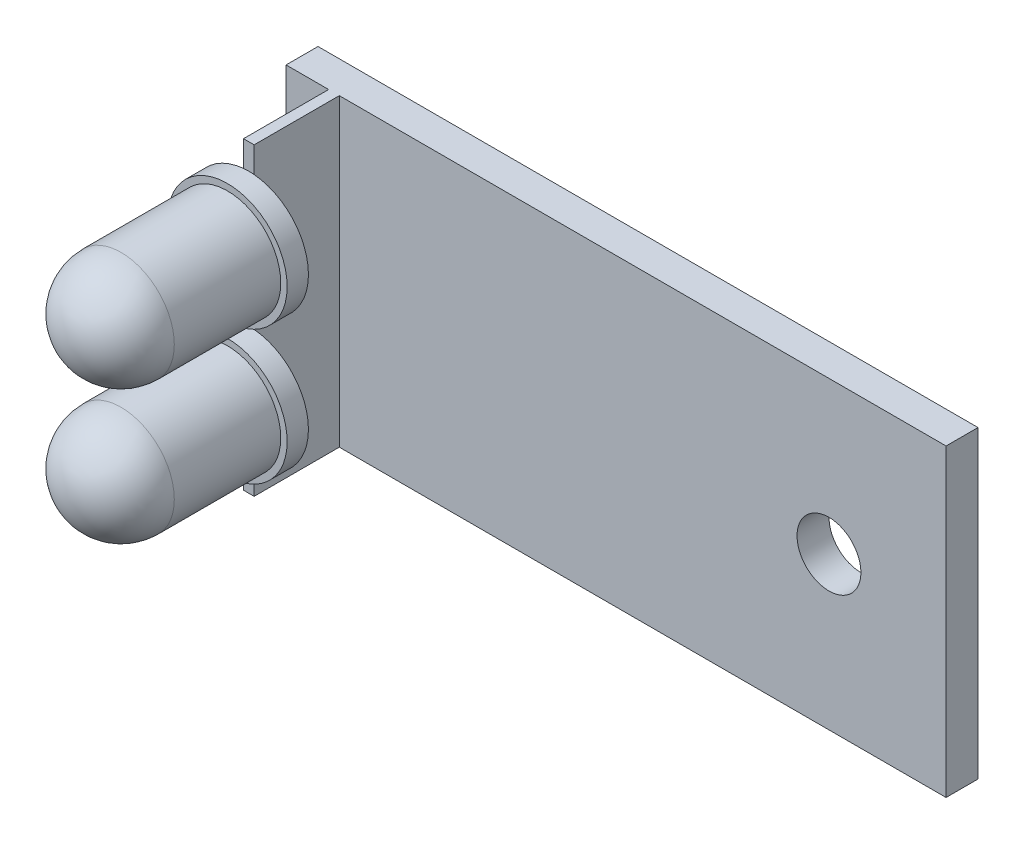
ISO-10303-21;
HEADER;
FILE_DESCRIPTION(('STEP AP214'),'2;1');
FILE_NAME('part.step','',(''),(''),'','','');
FILE_SCHEMA(('AUTOMOTIVE_DESIGN { 1 0 10303 214 1 1 1 1 }'));
ENDSEC;
DATA;
#1=APPLICATION_CONTEXT('core data for automotive mechanical design processes');
#2=APPLICATION_PROTOCOL_DEFINITION('international standard','automotive_design',2000,#1);
#3=PRODUCT_CONTEXT('',#1,'mechanical');
#4=PRODUCT('Part','Part','',(#3));
#5=PRODUCT_RELATED_PRODUCT_CATEGORY('part','',(#4));
#6=PRODUCT_DEFINITION_FORMATION('','',#4);
#7=PRODUCT_DEFINITION_CONTEXT('part definition',#1,'design');
#8=PRODUCT_DEFINITION('design','',#6,#7);
#9=PRODUCT_DEFINITION_SHAPE('','',#8);
#10=(LENGTH_UNIT() NAMED_UNIT(*) SI_UNIT(.MILLI.,.METRE.));
#11=(NAMED_UNIT(*) PLANE_ANGLE_UNIT() SI_UNIT($,.RADIAN.));
#12=(NAMED_UNIT(*) SI_UNIT($,.STERADIAN.) SOLID_ANGLE_UNIT());
#13=UNCERTAINTY_MEASURE_WITH_UNIT(LENGTH_MEASURE(1.E-05),#10,'distance_accuracy_value','');
#14=(GEOMETRIC_REPRESENTATION_CONTEXT(3) GLOBAL_UNCERTAINTY_ASSIGNED_CONTEXT((#13)) GLOBAL_UNIT_ASSIGNED_CONTEXT((#10,
#11,#12)) REPRESENTATION_CONTEXT('',''));
#15=CARTESIAN_POINT('',(0.,0.,0.));
#16=DIRECTION('',(0.,0.,1.));
#17=DIRECTION('',(1.,0.,0.));
#18=AXIS2_PLACEMENT_3D('',#15,#16,#17);
#19=CARTESIAN_POINT('',(2.,7.15,5.5));
#20=DIRECTION('',(0.,0.,1.));
#21=DIRECTION('',(1.,0.,0.));
#22=AXIS2_PLACEMENT_3D('',#19,#20,#21);
#23=PLANE('',#22);
#24=DIRECTION('',(0.,-1.,0.));
#25=VECTOR('',#24,1.);
#26=CARTESIAN_POINT('',(2.5,7.15,5.5));
#27=LINE('',#26,#25);
#28=CARTESIAN_POINT('',(2.5,0.361183046523129,5.5));
#29=VERTEX_POINT('',#28);
#30=CARTESIAN_POINT('',(2.5,-0.361183046523129,5.5));
#31=VERTEX_POINT('',#30);
#32=EDGE_CURVE('E145',#29,#31,#27,.T.);
#33=ORIENTED_EDGE('',*,*,#32,.F.);
#34=CARTESIAN_POINT('',(2.25,3.15,5.5));
#35=DIRECTION('',(0.,0.,-1.));
#36=DIRECTION('',(1.,0.,0.));
#37=AXIS2_PLACEMENT_3D('',#34,#35,#36);
#38=CIRCLE('',#37,2.8);
#39=CARTESIAN_POINT('',(2.,0.361183046523129,5.5));
#40=VERTEX_POINT('',#39);
#41=EDGE_CURVE('E53',#29,#40,#38,.T.);
#42=ORIENTED_EDGE('',*,*,#41,.T.);
#43=DIRECTION('',(0.,-1.,0.));
#44=VECTOR('',#43,1.);
#45=CARTESIAN_POINT('',(2.,7.15,5.5));
#46=LINE('',#45,#44);
#47=CARTESIAN_POINT('',(2.,-0.361183046523129,5.5));
#48=VERTEX_POINT('',#47);
#49=EDGE_CURVE('E143',#40,#48,#46,.T.);
#50=ORIENTED_EDGE('',*,*,#49,.T.);
#51=CARTESIAN_POINT('',(2.25,-3.15,5.5));
#52=DIRECTION('',(0.,0.,1.));
#53=DIRECTION('',(1.,0.,0.));
#54=AXIS2_PLACEMENT_3D('',#51,#52,#53);
#55=CIRCLE('',#54,2.8);
#56=EDGE_CURVE('E45',#31,#48,#55,.T.);
#57=ORIENTED_EDGE('',*,*,#56,.F.);
#58=EDGE_LOOP('',(#33,#42,#50,#57));
#59=FACE_BOUND('',#58,.T.);
#60=ADVANCED_FACE('F35',(#59),#23,.T.);
#61=CARTESIAN_POINT('',(2.,7.15,5.5));
#62=VERTEX_POINT('',#61);
#63=CARTESIAN_POINT('',(2.,5.93881695347687,5.5));
#64=VERTEX_POINT('',#63);
#65=EDGE_CURVE('E153',#62,#64,#46,.T.);
#66=ORIENTED_EDGE('',*,*,#65,.T.);
#67=CARTESIAN_POINT('',(2.5,5.93881695347687,5.5));
#68=VERTEX_POINT('',#67);
#69=EDGE_CURVE('E138',#64,#68,#38,.T.);
#70=ORIENTED_EDGE('',*,*,#69,.T.);
#71=CARTESIAN_POINT('',(2.5,7.15,5.5));
#72=VERTEX_POINT('',#71);
#73=EDGE_CURVE('E159',#72,#68,#27,.T.);
#74=ORIENTED_EDGE('',*,*,#73,.F.);
#75=DIRECTION('',(-1.,0.,0.));
#76=VECTOR('',#75,1.);
#77=CARTESIAN_POINT('',(2.,7.15,5.5));
#78=LINE('',#77,#76);
#79=EDGE_CURVE('E176',#72,#62,#78,.T.);
#80=ORIENTED_EDGE('',*,*,#79,.T.);
#81=EDGE_LOOP('',(#66,#70,#74,#80));
#82=FACE_BOUND('',#81,.T.);
#83=ADVANCED_FACE('F294',(#82),#23,.T.);
#84=CARTESIAN_POINT('',(0.,0.,1.5));
#85=DIRECTION('',(0.,0.,-1.));
#86=DIRECTION('',(-1.,0.,0.));
#87=AXIS2_PLACEMENT_3D('',#84,#85,#86);
#88=PLANE('',#87);
#89=DIRECTION('',(0.,-1.,0.));
#90=VECTOR('',#89,1.);
#91=CARTESIAN_POINT('',(2.,7.15,1.5));
#92=LINE('',#91,#90);
#93=CARTESIAN_POINT('',(2.,7.15,1.5));
#94=VERTEX_POINT('',#93);
#95=CARTESIAN_POINT('',(2.,-7.15,1.5));
#96=VERTEX_POINT('',#95);
#97=EDGE_CURVE('E156',#94,#96,#92,.T.);
#98=ORIENTED_EDGE('',*,*,#97,.F.);
#99=DIRECTION('',(-1.,0.,0.));
#100=VECTOR('',#99,1.);
#101=CARTESIAN_POINT('',(0.,7.15,1.5));
#102=LINE('',#101,#100);
#103=CARTESIAN_POINT('',(0.,7.15,1.5));
#104=VERTEX_POINT('',#103);
#105=EDGE_CURVE('E189',#94,#104,#102,.T.);
#106=ORIENTED_EDGE('',*,*,#105,.T.);
#107=DIRECTION('',(0.,-1.,0.));
#108=VECTOR('',#107,1.);
#109=CARTESIAN_POINT('',(0.,-7.15,1.5));
#110=LINE('',#109,#108);
#111=CARTESIAN_POINT('',(0.,-7.15,1.5));
#112=VERTEX_POINT('',#111);
#113=EDGE_CURVE('E179',#104,#112,#110,.T.);
#114=ORIENTED_EDGE('',*,*,#113,.T.);
#115=DIRECTION('',(1.,0.,0.));
#116=VECTOR('',#115,1.);
#117=CARTESIAN_POINT('',(0.,-7.15,1.5));
#118=LINE('',#117,#116);
#119=EDGE_CURVE('E184',#112,#96,#118,.T.);
#120=ORIENTED_EDGE('',*,*,#119,.T.);
#121=EDGE_LOOP('',(#98,#106,#114,#120));
#122=FACE_BOUND('',#121,.T.);
#123=ADVANCED_FACE('F246',(#122),#88,.F.);
#124=CARTESIAN_POINT('',(0.,-7.15,1.5));
#125=DIRECTION('',(1.,0.,0.));
#126=DIRECTION('',(0.,1.,0.));
#127=AXIS2_PLACEMENT_3D('',#124,#125,#126);
#128=PLANE('',#127);
#129=DIRECTION('',(0.,-1.,0.));
#130=VECTOR('',#129,1.);
#131=CARTESIAN_POINT('',(0.,-7.15,0.));
#132=LINE('',#131,#130);
#133=CARTESIAN_POINT('',(0.,7.15,0.));
#134=VERTEX_POINT('',#133);
#135=CARTESIAN_POINT('',(0.,-7.15,0.));
#136=VERTEX_POINT('',#135);
#137=EDGE_CURVE('E193',#134,#136,#132,.T.);
#138=ORIENTED_EDGE('',*,*,#137,.T.);
#139=DIRECTION('',(0.,0.,-1.));
#140=VECTOR('',#139,1.);
#141=CARTESIAN_POINT('',(0.,-7.15,1.5));
#142=LINE('',#141,#140);
#143=EDGE_CURVE('E39',#112,#136,#142,.T.);
#144=ORIENTED_EDGE('',*,*,#143,.F.);
#145=ORIENTED_EDGE('',*,*,#113,.F.);
#146=DIRECTION('',(0.,0.,-1.));
#147=VECTOR('',#146,1.);
#148=CARTESIAN_POINT('',(0.,7.15,1.5));
#149=LINE('',#148,#147);
#150=EDGE_CURVE('E192',#104,#134,#149,.T.);
#151=ORIENTED_EDGE('',*,*,#150,.T.);
#152=EDGE_LOOP('',(#138,#144,#145,#151));
#153=FACE_BOUND('',#152,.T.);
#154=ADVANCED_FACE('F37',(#153),#128,.F.);
#155=CARTESIAN_POINT('',(0.,-7.15,1.5));
#156=DIRECTION('',(0.,1.,0.));
#157=DIRECTION('',(-1.,0.,0.));
#158=AXIS2_PLACEMENT_3D('',#155,#156,#157);
#159=PLANE('',#158);
#160=DIRECTION('',(1.,0.,0.));
#161=VECTOR('',#160,1.);
#162=CARTESIAN_POINT('',(0.,-7.15,0.));
#163=LINE('',#162,#161);
#164=CARTESIAN_POINT('',(31.,-7.15,0.));
#165=VERTEX_POINT('',#164);
#166=EDGE_CURVE('E196',#136,#165,#163,.T.);
#167=ORIENTED_EDGE('',*,*,#166,.T.);
#168=DIRECTION('',(0.,0.,-1.));
#169=VECTOR('',#168,1.);
#170=CARTESIAN_POINT('',(31.,-7.15,1.5));
#171=LINE('',#170,#169);
#172=CARTESIAN_POINT('',(31.,-7.15,1.5));
#173=VERTEX_POINT('',#172);
#174=EDGE_CURVE('E205',#173,#165,#171,.T.);
#175=ORIENTED_EDGE('',*,*,#174,.F.);
#176=CARTESIAN_POINT('',(2.5,-7.15,1.5));
#177=VERTEX_POINT('',#176);
#178=EDGE_CURVE('E182',#177,#173,#118,.T.);
#179=ORIENTED_EDGE('',*,*,#178,.F.);
#180=DIRECTION('',(0.,0.,1.));
#181=VECTOR('',#180,1.);
#182=CARTESIAN_POINT('',(2.5,-7.15,1.5));
#183=LINE('',#182,#181);
#184=CARTESIAN_POINT('',(2.5,-7.15,5.5));
#185=VERTEX_POINT('',#184);
#186=EDGE_CURVE('E233',#177,#185,#183,.T.);
#187=ORIENTED_EDGE('',*,*,#186,.T.);
#188=DIRECTION('',(-1.,0.,0.));
#189=VECTOR('',#188,1.);
#190=CARTESIAN_POINT('',(2.,-7.15,5.5));
#191=LINE('',#190,#189);
#192=CARTESIAN_POINT('',(2.,-7.15,5.5));
#193=VERTEX_POINT('',#192);
#194=EDGE_CURVE('E234',#185,#193,#191,.T.);
#195=ORIENTED_EDGE('',*,*,#194,.T.);
#196=DIRECTION('',(0.,0.,-1.));
#197=VECTOR('',#196,1.);
#198=CARTESIAN_POINT('',(2.,-7.15,1.5));
#199=LINE('',#198,#197);
#200=EDGE_CURVE('E236',#193,#96,#199,.T.);
#201=ORIENTED_EDGE('',*,*,#200,.T.);
#202=ORIENTED_EDGE('',*,*,#119,.F.);
#203=ORIENTED_EDGE('',*,*,#143,.T.);
#204=EDGE_LOOP('',(#167,#175,#179,#187,#195,#201,#202,#203));
#205=FACE_BOUND('',#204,.T.);
#206=ADVANCED_FACE('F214',(#205),#159,.F.);
#207=CARTESIAN_POINT('',(31.,-7.15,1.5));
#208=DIRECTION('',(-1.,0.,0.));
#209=DIRECTION('',(0.,0.,1.));
#210=AXIS2_PLACEMENT_3D('',#207,#208,#209);
#211=PLANE('',#210);
#212=DIRECTION('',(0.,1.,0.));
#213=VECTOR('',#212,1.);
#214=CARTESIAN_POINT('',(31.,-7.15,0.));
#215=LINE('',#214,#213);
#216=CARTESIAN_POINT('',(31.,7.15,0.));
#217=VERTEX_POINT('',#216);
#218=EDGE_CURVE('E198',#165,#217,#215,.T.);
#219=ORIENTED_EDGE('',*,*,#218,.T.);
#220=DIRECTION('',(0.,0.,-1.));
#221=VECTOR('',#220,1.);
#222=CARTESIAN_POINT('',(31.,7.15,1.5));
#223=LINE('',#222,#221);
#224=CARTESIAN_POINT('',(31.,7.15,1.5));
#225=VERTEX_POINT('',#224);
#226=EDGE_CURVE('E203',#225,#217,#223,.T.);
#227=ORIENTED_EDGE('',*,*,#226,.F.);
#228=DIRECTION('',(0.,1.,0.));
#229=VECTOR('',#228,1.);
#230=CARTESIAN_POINT('',(31.,-7.15,1.5));
#231=LINE('',#230,#229);
#232=EDGE_CURVE('E187',#173,#225,#231,.T.);
#233=ORIENTED_EDGE('',*,*,#232,.F.);
#234=ORIENTED_EDGE('',*,*,#174,.T.);
#235=EDGE_LOOP('',(#219,#227,#233,#234));
#236=FACE_BOUND('',#235,.T.);
#237=ADVANCED_FACE('F224',(#236),#211,.F.);
#238=CARTESIAN_POINT('',(0.,7.15,1.5));
#239=DIRECTION('',(0.,-1.,0.));
#240=DIRECTION('',(1.,0.,0.));
#241=AXIS2_PLACEMENT_3D('',#238,#239,#240);
#242=PLANE('',#241);
#243=DIRECTION('',(-1.,0.,0.));
#244=VECTOR('',#243,1.);
#245=CARTESIAN_POINT('',(0.,7.15,0.));
#246=LINE('',#245,#244);
#247=EDGE_CURVE('E183',#217,#134,#246,.T.);
#248=ORIENTED_EDGE('',*,*,#247,.T.);
#249=ORIENTED_EDGE('',*,*,#150,.F.);
#250=ORIENTED_EDGE('',*,*,#105,.F.);
#251=DIRECTION('',(0.,0.,-1.));
#252=VECTOR('',#251,1.);
#253=CARTESIAN_POINT('',(2.,7.15,1.5));
#254=LINE('',#253,#252);
#255=EDGE_CURVE('E172',#62,#94,#254,.T.);
#256=ORIENTED_EDGE('',*,*,#255,.F.);
#257=ORIENTED_EDGE('',*,*,#79,.F.);
#258=DIRECTION('',(0.,0.,1.));
#259=VECTOR('',#258,1.);
#260=CARTESIAN_POINT('',(2.5,7.15,1.5));
#261=LINE('',#260,#259);
#262=CARTESIAN_POINT('',(2.5,7.15,1.5));
#263=VERTEX_POINT('',#262);
#264=EDGE_CURVE('E230',#263,#72,#261,.T.);
#265=ORIENTED_EDGE('',*,*,#264,.F.);
#266=EDGE_CURVE('E190',#225,#263,#102,.T.);
#267=ORIENTED_EDGE('',*,*,#266,.F.);
#268=ORIENTED_EDGE('',*,*,#226,.T.);
#269=EDGE_LOOP('',(#248,#249,#250,#256,#257,#265,#267,#268));
#270=FACE_BOUND('',#269,.T.);
#271=ADVANCED_FACE('F227',(#270),#242,.F.);
#272=CARTESIAN_POINT('',(25.5,0.,1.5));
#273=DIRECTION('',(0.,0.,1.));
#274=DIRECTION('',(1.,0.,0.));
#275=AXIS2_PLACEMENT_3D('',#272,#273,#274);
#276=CIRCLE('',#275,1.5);
#277=CARTESIAN_POINT('',(27.,0.,1.5));
#278=VERTEX_POINT('',#277);
#279=EDGE_CURVE('E270',#278,#278,#276,.T.);
#280=ORIENTED_EDGE('',*,*,#279,.F.);
#281=EDGE_LOOP('',(#280));
#282=FACE_BOUND('',#281,.T.);
#283=ORIENTED_EDGE('',*,*,#266,.T.);
#284=DIRECTION('',(0.,-1.,0.));
#285=VECTOR('',#284,1.);
#286=CARTESIAN_POINT('',(2.5,7.15,1.5));
#287=LINE('',#286,#285);
#288=EDGE_CURVE('E170',#263,#177,#287,.T.);
#289=ORIENTED_EDGE('',*,*,#288,.T.);
#290=ORIENTED_EDGE('',*,*,#178,.T.);
#291=ORIENTED_EDGE('',*,*,#232,.T.);
#292=EDGE_LOOP('',(#283,#289,#290,#291));
#293=FACE_BOUND('',#292,.T.);
#294=ADVANCED_FACE('F231',(#282,#293),#88,.F.);
#295=CARTESIAN_POINT('',(0.,0.,0.));
#296=DIRECTION('',(0.,0.,-1.));
#297=DIRECTION('',(-1.,0.,0.));
#298=AXIS2_PLACEMENT_3D('',#295,#296,#297);
#299=PLANE('',#298);
#300=CARTESIAN_POINT('',(25.5,0.,0.));
#301=DIRECTION('',(0.,0.,1.));
#302=DIRECTION('',(1.,0.,0.));
#303=AXIS2_PLACEMENT_3D('',#300,#301,#302);
#304=CIRCLE('',#303,1.5);
#305=CARTESIAN_POINT('',(27.,0.,0.));
#306=VERTEX_POINT('',#305);
#307=EDGE_CURVE('E269',#306,#306,#304,.T.);
#308=ORIENTED_EDGE('',*,*,#307,.T.);
#309=EDGE_LOOP('',(#308));
#310=FACE_BOUND('',#309,.T.);
#311=ORIENTED_EDGE('',*,*,#137,.F.);
#312=ORIENTED_EDGE('',*,*,#247,.F.);
#313=ORIENTED_EDGE('',*,*,#218,.F.);
#314=ORIENTED_EDGE('',*,*,#166,.F.);
#315=EDGE_LOOP('',(#311,#312,#313,#314));
#316=FACE_BOUND('',#315,.T.);
#317=ADVANCED_FACE('F222',(#310,#316),#299,.T.);
#318=CARTESIAN_POINT('',(2.,7.15,1.5));
#319=DIRECTION('',(-1.,0.,0.));
#320=DIRECTION('',(0.,0.,1.));
#321=AXIS2_PLACEMENT_3D('',#318,#319,#320);
#322=PLANE('',#321);
#323=ORIENTED_EDGE('',*,*,#200,.F.);
#324=CARTESIAN_POINT('',(2.,-5.93881695347687,5.5));
#325=VERTEX_POINT('',#324);
#326=EDGE_CURVE('E155',#325,#193,#46,.T.);
#327=ORIENTED_EDGE('',*,*,#326,.F.);
#328=EDGE_CURVE('E151',#48,#325,#46,.T.);
#329=ORIENTED_EDGE('',*,*,#328,.F.);
#330=ORIENTED_EDGE('',*,*,#49,.F.);
#331=DIRECTION('',(0.,1.,0.));
#332=VECTOR('',#331,1.);
#333=CARTESIAN_POINT('',(2.,7.15,5.5));
#334=LINE('',#333,#332);
#335=EDGE_CURVE('E128',#40,#64,#334,.T.);
#336=ORIENTED_EDGE('',*,*,#335,.T.);
#337=ORIENTED_EDGE('',*,*,#65,.F.);
#338=ORIENTED_EDGE('',*,*,#255,.T.);
#339=ORIENTED_EDGE('',*,*,#97,.T.);
#340=EDGE_LOOP('',(#323,#327,#329,#330,#336,#337,#338,#339));
#341=FACE_BOUND('',#340,.T.);
#342=ADVANCED_FACE('F149',(#341),#322,.T.);
#343=CARTESIAN_POINT('',(2.5,-5.93881695347687,5.5));
#344=VERTEX_POINT('',#343);
#345=EDGE_CURVE('E11',#325,#344,#55,.T.);
#346=ORIENTED_EDGE('',*,*,#345,.F.);
#347=ORIENTED_EDGE('',*,*,#326,.T.);
#348=ORIENTED_EDGE('',*,*,#194,.F.);
#349=EDGE_CURVE('E167',#344,#185,#27,.T.);
#350=ORIENTED_EDGE('',*,*,#349,.F.);
#351=EDGE_LOOP('',(#346,#347,#348,#350));
#352=FACE_BOUND('',#351,.T.);
#353=ADVANCED_FACE('F297',(#352),#23,.T.);
#354=CARTESIAN_POINT('',(2.5,7.15,1.5));
#355=DIRECTION('',(1.,0.,0.));
#356=DIRECTION('',(0.,0.,-1.));
#357=AXIS2_PLACEMENT_3D('',#354,#355,#356);
#358=PLANE('',#357);
#359=ORIENTED_EDGE('',*,*,#186,.F.);
#360=ORIENTED_EDGE('',*,*,#288,.F.);
#361=ORIENTED_EDGE('',*,*,#264,.T.);
#362=ORIENTED_EDGE('',*,*,#73,.T.);
#363=EDGE_CURVE('E163',#68,#29,#27,.T.);
#364=ORIENTED_EDGE('',*,*,#363,.T.);
#365=ORIENTED_EDGE('',*,*,#32,.T.);
#366=EDGE_CURVE('E164',#31,#344,#27,.T.);
#367=ORIENTED_EDGE('',*,*,#366,.T.);
#368=ORIENTED_EDGE('',*,*,#349,.T.);
#369=EDGE_LOOP('',(#359,#360,#361,#362,#364,#365,#367,#368));
#370=FACE_BOUND('',#369,.T.);
#371=ADVANCED_FACE('F249',(#370),#358,.T.);
#372=CARTESIAN_POINT('',(2.25,-3.15,5.5));
#373=DIRECTION('',(0.,0.,1.));
#374=DIRECTION('',(1.,0.,0.));
#375=AXIS2_PLACEMENT_3D('',#372,#373,#374);
#376=PLANE('',#375);
#377=EDGE_CURVE('E46',#48,#325,#55,.T.);
#378=ORIENTED_EDGE('',*,*,#377,.F.);
#379=ORIENTED_EDGE('',*,*,#328,.T.);
#380=EDGE_LOOP('',(#378,#379));
#381=FACE_BOUND('',#380,.T.);
#382=ADVANCED_FACE('F307',(#381),#376,.F.);
#383=ORIENTED_EDGE('',*,*,#366,.F.);
#384=EDGE_CURVE('E239',#344,#31,#55,.T.);
#385=ORIENTED_EDGE('',*,*,#384,.F.);
#386=EDGE_LOOP('',(#383,#385));
#387=FACE_BOUND('',#386,.T.);
#388=ADVANCED_FACE('F311',(#387),#376,.F.);
#389=CARTESIAN_POINT('',(2.25,-3.15,14.));
#390=DIRECTION('',(0.,0.,1.));
#391=DIRECTION('',(1.,0.,0.));
#392=AXIS2_PLACEMENT_3D('',#389,#390,#391);
#393=CYLINDRICAL_SURFACE('',#392,2.8);
#394=CARTESIAN_POINT('',(2.25,-3.15,6.5));
#395=DIRECTION('',(0.,0.,1.));
#396=DIRECTION('',(1.,0.,0.));
#397=AXIS2_PLACEMENT_3D('',#394,#395,#396);
#398=CIRCLE('',#397,2.8);
#399=CARTESIAN_POINT('',(5.05,-3.15,6.5));
#400=VERTEX_POINT('',#399);
#401=EDGE_CURVE('E252',#400,#400,#398,.T.);
#402=ORIENTED_EDGE('',*,*,#401,.F.);
#403=EDGE_LOOP('',(#402));
#404=FACE_BOUND('',#403,.T.);
#405=ORIENTED_EDGE('',*,*,#56,.T.);
#406=ORIENTED_EDGE('',*,*,#377,.T.);
#407=ORIENTED_EDGE('',*,*,#345,.T.);
#408=ORIENTED_EDGE('',*,*,#384,.T.);
#409=EDGE_LOOP('',(#405,#406,#407,#408));
#410=FACE_BOUND('',#409,.T.);
#411=ADVANCED_FACE('F314',(#404,#410),#393,.T.);
#412=CARTESIAN_POINT('',(5.05,-3.15,6.5));
#413=DIRECTION('',(0.,0.,-1.));
#414=DIRECTION('',(-1.,0.,0.));
#415=AXIS2_PLACEMENT_3D('',#412,#413,#414);
#416=PLANE('',#415);
#417=CARTESIAN_POINT('',(2.25,-3.15,6.5));
#418=DIRECTION('',(0.,0.,1.));
#419=DIRECTION('',(1.,0.,0.));
#420=AXIS2_PLACEMENT_3D('',#417,#418,#419);
#421=CIRCLE('',#420,2.5);
#422=CARTESIAN_POINT('',(4.75,-3.15,6.5));
#423=VERTEX_POINT('',#422);
#424=EDGE_CURVE('E255',#423,#423,#421,.T.);
#425=ORIENTED_EDGE('',*,*,#424,.F.);
#426=EDGE_LOOP('',(#425));
#427=FACE_BOUND('',#426,.T.);
#428=ORIENTED_EDGE('',*,*,#401,.T.);
#429=EDGE_LOOP('',(#428));
#430=FACE_BOUND('',#429,.T.);
#431=ADVANCED_FACE('F318',(#427,#430),#416,.F.);
#432=CARTESIAN_POINT('',(2.25,-3.15,14.));
#433=DIRECTION('',(0.,0.,1.));
#434=DIRECTION('',(1.,0.,0.));
#435=AXIS2_PLACEMENT_3D('',#432,#433,#434);
#436=CYLINDRICAL_SURFACE('',#435,2.5);
#437=CARTESIAN_POINT('',(2.25,-3.15,11.4999984919274));
#438=DIRECTION('',(0.,0.,1.));
#439=DIRECTION('',(1.,0.,0.));
#440=AXIS2_PLACEMENT_3D('',#437,#438,#439);
#441=CIRCLE('',#440,2.5);
#442=CARTESIAN_POINT('',(4.75,-3.15,11.4999984919274));
#443=VERTEX_POINT('',#442);
#444=EDGE_CURVE('E134',#443,#443,#441,.T.);
#445=ORIENTED_EDGE('',*,*,#444,.F.);
#446=EDGE_LOOP('',(#445));
#447=FACE_BOUND('',#446,.T.);
#448=ORIENTED_EDGE('',*,*,#424,.T.);
#449=EDGE_LOOP('',(#448));
#450=FACE_BOUND('',#449,.T.);
#451=ADVANCED_FACE('F322',(#447,#450),#436,.T.);
#452=CARTESIAN_POINT('',(2.25,-3.15,11.4999999999995));
#453=DIRECTION('',(0.,0.,1.));
#454=DIRECTION('',(1.,0.,0.));
#455=AXIS2_PLACEMENT_3D('',#452,#453,#454);
#456=SPHERICAL_SURFACE('',#455,2.50000000000046);
#457=ORIENTED_EDGE('',*,*,#444,.T.);
#458=EDGE_LOOP('',(#457));
#459=FACE_BOUND('',#458,.T.);
#460=ADVANCED_FACE('F326',(#459),#456,.T.);
#461=CARTESIAN_POINT('',(2.25,3.15,5.5));
#462=DIRECTION('',(0.,0.,1.));
#463=DIRECTION('',(1.,0.,0.));
#464=AXIS2_PLACEMENT_3D('',#461,#462,#463);
#465=PLANE('',#464);
#466=ORIENTED_EDGE('',*,*,#335,.F.);
#467=EDGE_CURVE('E130',#40,#64,#38,.T.);
#468=ORIENTED_EDGE('',*,*,#467,.T.);
#469=EDGE_LOOP('',(#466,#468));
#470=FACE_BOUND('',#469,.T.);
#471=ADVANCED_FACE('F129',(#470),#465,.F.);
#472=ORIENTED_EDGE('',*,*,#363,.F.);
#473=EDGE_CURVE('E147',#68,#29,#38,.T.);
#474=ORIENTED_EDGE('',*,*,#473,.T.);
#475=EDGE_LOOP('',(#472,#474));
#476=FACE_BOUND('',#475,.T.);
#477=ADVANCED_FACE('F331',(#476),#465,.F.);
#478=CARTESIAN_POINT('',(2.25,3.15,14.));
#479=DIRECTION('',(0.,0.,1.));
#480=DIRECTION('',(1.,0.,0.));
#481=AXIS2_PLACEMENT_3D('',#478,#479,#480);
#482=CYLINDRICAL_SURFACE('',#481,2.8);
#483=CARTESIAN_POINT('',(2.25,3.15,6.5));
#484=DIRECTION('',(0.,0.,-1.));
#485=DIRECTION('',(1.,0.,0.));
#486=AXIS2_PLACEMENT_3D('',#483,#484,#485);
#487=CIRCLE('',#486,2.8);
#488=CARTESIAN_POINT('',(5.05,3.15,6.5));
#489=VERTEX_POINT('',#488);
#490=EDGE_CURVE('E260',#489,#489,#487,.T.);
#491=ORIENTED_EDGE('',*,*,#490,.T.);
#492=EDGE_LOOP('',(#491));
#493=FACE_BOUND('',#492,.T.);
#494=ORIENTED_EDGE('',*,*,#41,.F.);
#495=ORIENTED_EDGE('',*,*,#473,.F.);
#496=ORIENTED_EDGE('',*,*,#69,.F.);
#497=ORIENTED_EDGE('',*,*,#467,.F.);
#498=EDGE_LOOP('',(#494,#495,#496,#497));
#499=FACE_BOUND('',#498,.T.);
#500=ADVANCED_FACE('F136',(#493,#499),#482,.T.);
#501=CARTESIAN_POINT('',(5.05,3.15,6.5));
#502=DIRECTION('',(0.,0.,-1.));
#503=DIRECTION('',(-1.,0.,0.));
#504=AXIS2_PLACEMENT_3D('',#501,#502,#503);
#505=PLANE('',#504);
#506=CARTESIAN_POINT('',(2.25,3.15,6.5));
#507=DIRECTION('',(0.,0.,-1.));
#508=DIRECTION('',(1.,0.,0.));
#509=AXIS2_PLACEMENT_3D('',#506,#507,#508);
#510=CIRCLE('',#509,2.5);
#511=CARTESIAN_POINT('',(4.75,3.15,6.5));
#512=VERTEX_POINT('',#511);
#513=EDGE_CURVE('E263',#512,#512,#510,.T.);
#514=ORIENTED_EDGE('',*,*,#513,.T.);
#515=EDGE_LOOP('',(#514));
#516=FACE_BOUND('',#515,.T.);
#517=ORIENTED_EDGE('',*,*,#490,.F.);
#518=EDGE_LOOP('',(#517));
#519=FACE_BOUND('',#518,.T.);
#520=ADVANCED_FACE('F337',(#516,#519),#505,.F.);
#521=CARTESIAN_POINT('',(2.25,3.15,14.));
#522=DIRECTION('',(0.,0.,1.));
#523=DIRECTION('',(1.,0.,0.));
#524=AXIS2_PLACEMENT_3D('',#521,#522,#523);
#525=CYLINDRICAL_SURFACE('',#524,2.5);
#526=CARTESIAN_POINT('',(2.25,3.15,11.4999984919274));
#527=DIRECTION('',(0.,0.,-1.));
#528=DIRECTION('',(1.,0.,0.));
#529=AXIS2_PLACEMENT_3D('',#526,#527,#528);
#530=CIRCLE('',#529,2.5);
#531=CARTESIAN_POINT('',(4.75,3.15,11.4999984919274));
#532=VERTEX_POINT('',#531);
#533=EDGE_CURVE('E266',#532,#532,#530,.T.);
#534=ORIENTED_EDGE('',*,*,#533,.T.);
#535=EDGE_LOOP('',(#534));
#536=FACE_BOUND('',#535,.T.);
#537=ORIENTED_EDGE('',*,*,#513,.F.);
#538=EDGE_LOOP('',(#537));
#539=FACE_BOUND('',#538,.T.);
#540=ADVANCED_FACE('F341',(#536,#539),#525,.T.);
#541=CARTESIAN_POINT('',(2.25,3.15,11.4999999999995));
#542=DIRECTION('',(0.,0.,1.));
#543=DIRECTION('',(1.,0.,0.));
#544=AXIS2_PLACEMENT_3D('',#541,#542,#543);
#545=SPHERICAL_SURFACE('',#544,2.50000000000046);
#546=ORIENTED_EDGE('',*,*,#533,.F.);
#547=EDGE_LOOP('',(#546));
#548=FACE_BOUND('',#547,.T.);
#549=ADVANCED_FACE('F280',(#548),#545,.T.);
#550=CARTESIAN_POINT('',(25.5,0.,0.));
#551=DIRECTION('',(0.,0.,1.));
#552=DIRECTION('',(1.,0.,0.));
#553=AXIS2_PLACEMENT_3D('',#550,#551,#552);
#554=CYLINDRICAL_SURFACE('',#553,1.5);
#555=ORIENTED_EDGE('',*,*,#307,.F.);
#556=EDGE_LOOP('',(#555));
#557=FACE_BOUND('',#556,.T.);
#558=ORIENTED_EDGE('',*,*,#279,.T.);
#559=EDGE_LOOP('',(#558));
#560=FACE_BOUND('',#559,.T.);
#561=ADVANCED_FACE('F277',(#557,#560),#554,.F.);
#562=CLOSED_SHELL('',(#60,#83,#123,#154,#206,#237,#271,#294,#317,#342,#353,#371,#382,#388,#411,
#431,#451,#460,#471,#477,#500,#520,#540,#549,#561));
#563=MANIFOLD_SOLID_BREP('B2',#562);
#564=ADVANCED_BREP_SHAPE_REPRESENTATION('',(#18,#563),#14);
#565=SHAPE_DEFINITION_REPRESENTATION(#9,#564);
ENDSEC;
END-ISO-10303-21;
